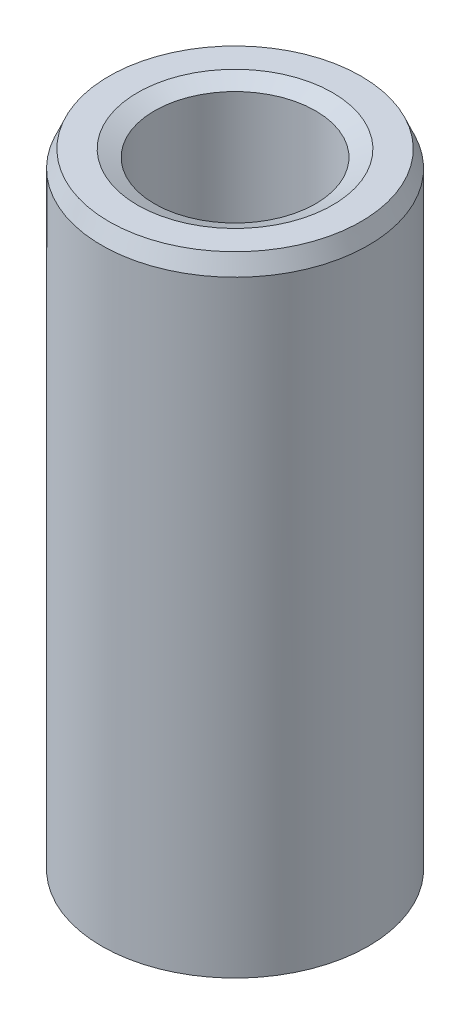
ISO-10303-21;
HEADER;
FILE_DESCRIPTION(('STEP AP214'),'2;1');
FILE_NAME('part.step','',(''),(''),'','','');
FILE_SCHEMA(('AUTOMOTIVE_DESIGN { 1 0 10303 214 1 1 1 1 }'));
ENDSEC;
DATA;
#1=APPLICATION_CONTEXT('core data for automotive mechanical design processes');
#2=APPLICATION_PROTOCOL_DEFINITION('international standard','automotive_design',2000,#1);
#3=PRODUCT_CONTEXT('',#1,'mechanical');
#4=PRODUCT('Part','Part','',(#3));
#5=PRODUCT_RELATED_PRODUCT_CATEGORY('part','',(#4));
#6=PRODUCT_DEFINITION_FORMATION('','',#4);
#7=PRODUCT_DEFINITION_CONTEXT('part definition',#1,'design');
#8=PRODUCT_DEFINITION('design','',#6,#7);
#9=PRODUCT_DEFINITION_SHAPE('','',#8);
#10=(LENGTH_UNIT() NAMED_UNIT(*) SI_UNIT(.MILLI.,.METRE.));
#11=(NAMED_UNIT(*) PLANE_ANGLE_UNIT() SI_UNIT($,.RADIAN.));
#12=(NAMED_UNIT(*) SI_UNIT($,.STERADIAN.) SOLID_ANGLE_UNIT());
#13=UNCERTAINTY_MEASURE_WITH_UNIT(LENGTH_MEASURE(1.E-05),#10,'distance_accuracy_value','');
#14=(GEOMETRIC_REPRESENTATION_CONTEXT(3) GLOBAL_UNCERTAINTY_ASSIGNED_CONTEXT((#13)) GLOBAL_UNIT_ASSIGNED_CONTEXT((#10,
#11,#12)) REPRESENTATION_CONTEXT('',''));
#15=CARTESIAN_POINT('',(0.,0.,0.));
#16=DIRECTION('',(0.,0.,1.));
#17=DIRECTION('',(1.,0.,0.));
#18=AXIS2_PLACEMENT_3D('',#15,#16,#17);
#19=CARTESIAN_POINT('',(0.,106.518927393168,0.));
#20=DIRECTION('',(0.,-1.,0.));
#21=DIRECTION('',(0.,0.,-1.));
#22=AXIS2_PLACEMENT_3D('',#19,#20,#21);
#23=CYLINDRICAL_SURFACE('',#22,22.5);
#24=CARTESIAN_POINT('',(0.,1.23412668733276,0.));
#25=DIRECTION('',(0.,1.,0.));
#26=DIRECTION('',(0.,0.,1.));
#27=AXIS2_PLACEMENT_3D('',#24,#25,#26);
#28=CIRCLE('',#27,22.5);
#29=CARTESIAN_POINT('',(0.,1.23412668733276,22.5));
#30=VERTEX_POINT('',#29);
#31=EDGE_CURVE('E10',#30,#30,#28,.T.);
#32=ORIENTED_EDGE('',*,*,#31,.T.);
#33=EDGE_LOOP('',(#32));
#34=FACE_BOUND('',#33,.T.);
#35=CARTESIAN_POINT('',(0.,103.661343386868,0.));
#36=DIRECTION('',(0.,1.,0.));
#37=DIRECTION('',(0.,0.,1.));
#38=AXIS2_PLACEMENT_3D('',#35,#36,#37);
#39=CIRCLE('',#38,22.5);
#40=CARTESIAN_POINT('',(0.,103.661343386868,-22.5));
#41=VERTEX_POINT('',#40);
#42=EDGE_CURVE('E50',#41,#41,#39,.F.);
#43=ORIENTED_EDGE('',*,*,#42,.T.);
#44=EDGE_LOOP('',(#43));
#45=FACE_BOUND('',#44,.T.);
#46=ADVANCED_FACE('F39',(#34,#45),#23,.T.);
#47=CARTESIAN_POINT('',(0.,106.518927393168,0.));
#48=DIRECTION('',(0.,1.,0.));
#49=DIRECTION('',(0.,0.,1.));
#50=AXIS2_PLACEMENT_3D('',#47,#48,#49);
#51=PLANE('',#50);
#52=CARTESIAN_POINT('',(0.,106.518927393168,0.));
#53=DIRECTION('',(0.,1.,0.));
#54=DIRECTION('',(0.,0.,1.));
#55=AXIS2_PLACEMENT_3D('',#52,#53,#54);
#56=CIRCLE('',#55,16.4554926298678);
#57=CARTESIAN_POINT('',(0.,106.518927393168,16.4554926298678));
#58=VERTEX_POINT('',#57);
#59=EDGE_CURVE('E58',#58,#58,#56,.F.);
#60=ORIENTED_EDGE('',*,*,#59,.T.);
#61=EDGE_LOOP('',(#60));
#62=FACE_BOUND('',#61,.T.);
#63=CARTESIAN_POINT('',(0.,106.518927393168,0.));
#64=DIRECTION('',(0.,1.,0.));
#65=DIRECTION('',(0.,0.,1.));
#66=AXIS2_PLACEMENT_3D('',#63,#64,#65);
#67=CIRCLE('',#66,21.2658733126672);
#68=CARTESIAN_POINT('',(0.,106.518927393168,-21.2658733126673));
#69=VERTEX_POINT('',#68);
#70=EDGE_CURVE('E61',#69,#69,#67,.T.);
#71=ORIENTED_EDGE('',*,*,#70,.T.);
#72=EDGE_LOOP('',(#71));
#73=FACE_BOUND('',#72,.T.);
#74=ADVANCED_FACE('F88',(#62,#73),#51,.T.);
#75=CARTESIAN_POINT('',(0.,0.,0.));
#76=DIRECTION('',(0.,1.,0.));
#77=DIRECTION('',(0.,0.,1.));
#78=AXIS2_PLACEMENT_3D('',#75,#76,#77);
#79=PLANE('',#78);
#80=CARTESIAN_POINT('',(0.,0.,0.));
#81=DIRECTION('',(0.,1.,0.));
#82=DIRECTION('',(0.,0.,1.));
#83=AXIS2_PLACEMENT_3D('',#80,#81,#82);
#84=CIRCLE('',#83,14.8320353109006);
#85=CARTESIAN_POINT('',(0.,0.,-14.8320353109006));
#86=VERTEX_POINT('',#85);
#87=EDGE_CURVE('E51',#86,#86,#84,.T.);
#88=ORIENTED_EDGE('',*,*,#87,.T.);
#89=EDGE_LOOP('',(#88));
#90=FACE_BOUND('',#89,.T.);
#91=CARTESIAN_POINT('',(0.,0.,0.));
#92=DIRECTION('',(0.,1.,0.));
#93=DIRECTION('',(0.,0.,1.));
#94=AXIS2_PLACEMENT_3D('',#91,#92,#93);
#95=CIRCLE('',#94,19.6424159937);
#96=CARTESIAN_POINT('',(0.,0.,19.6424159937));
#97=VERTEX_POINT('',#96);
#98=EDGE_CURVE('E54',#97,#97,#95,.F.);
#99=ORIENTED_EDGE('',*,*,#98,.T.);
#100=EDGE_LOOP('',(#99));
#101=FACE_BOUND('',#100,.T.);
#102=ADVANCED_FACE('F83',(#90,#101),#79,.F.);
#103=CARTESIAN_POINT('',(0.,106.518927393168,0.));
#104=DIRECTION('',(0.,-1.,0.));
#105=DIRECTION('',(0.,0.,-1.));
#106=AXIS2_PLACEMENT_3D('',#103,#104,#105);
#107=CYLINDRICAL_SURFACE('',#106,13.5979086235678);
#108=CARTESIAN_POINT('',(0.,105.284800705835,0.));
#109=DIRECTION('',(0.,1.,0.));
#110=DIRECTION('',(0.,0.,1.));
#111=AXIS2_PLACEMENT_3D('',#108,#109,#110);
#112=CIRCLE('',#111,13.5979086235678);
#113=CARTESIAN_POINT('',(0.,105.284800705835,13.5979086235678));
#114=VERTEX_POINT('',#113);
#115=EDGE_CURVE('E67',#114,#114,#112,.T.);
#116=ORIENTED_EDGE('',*,*,#115,.T.);
#117=EDGE_LOOP('',(#116));
#118=FACE_BOUND('',#117,.T.);
#119=CARTESIAN_POINT('',(0.,2.8575840063,0.));
#120=DIRECTION('',(0.,1.,0.));
#121=DIRECTION('',(0.,0.,1.));
#122=AXIS2_PLACEMENT_3D('',#119,#120,#121);
#123=CIRCLE('',#122,13.5979086235678);
#124=CARTESIAN_POINT('',(0.,2.8575840063,-13.5979086235678));
#125=VERTEX_POINT('',#124);
#126=EDGE_CURVE('E69',#125,#125,#123,.F.);
#127=ORIENTED_EDGE('',*,*,#126,.T.);
#128=EDGE_LOOP('',(#127));
#129=FACE_BOUND('',#128,.T.);
#130=ADVANCED_FACE('F71',(#118,#129),#107,.F.);
#131=CARTESIAN_POINT('',(0.,105.284800705835,0.));
#132=DIRECTION('',(0.,1.,0.));
#133=DIRECTION('',(0.,0.,1.));
#134=AXIS2_PLACEMENT_3D('',#131,#132,#133);
#135=CONICAL_SURFACE('',#134,13.5979086235678,1.16311469385704);
#136=ORIENTED_EDGE('',*,*,#59,.F.);
#137=EDGE_LOOP('',(#136));
#138=FACE_BOUND('',#137,.T.);
#139=ORIENTED_EDGE('',*,*,#115,.F.);
#140=EDGE_LOOP('',(#139));
#141=FACE_BOUND('',#140,.T.);
#142=ADVANCED_FACE('F77',(#138,#141),#135,.F.);
#143=CARTESIAN_POINT('',(0.,0.,0.));
#144=DIRECTION('',(0.,-1.,0.));
#145=DIRECTION('',(0.,0.,-1.));
#146=AXIS2_PLACEMENT_3D('',#143,#144,#145);
#147=CONICAL_SURFACE('',#146,14.8320353109006,0.407681632937855);
#148=CARTESIAN_POINT('',(0.,2.8575840063,-13.5979086235678));
#149=CARTESIAN_POINT('',(0.,2.82781750623437,-13.6107641098942));
#150=CARTESIAN_POINT('',(0.,2.79805100616875,-13.6236195962206));
#151=CARTESIAN_POINT('',(0.,2.7385180060375,-13.6493305688733));
#152=CARTESIAN_POINT('',(0.,2.70875150597187,-13.6621860551997));
#153=CARTESIAN_POINT('',(0.,2.64921850584062,-13.6878970278525));
#154=CARTESIAN_POINT('',(0.,2.619452005775,-13.7007525141789));
#155=CARTESIAN_POINT('',(0.,2.55991900564375,-13.7264634868316));
#156=CARTESIAN_POINT('',(0.,2.53015250557812,-13.739318973158));
#157=CARTESIAN_POINT('',(0.,2.47061950544687,-13.7650299458108));
#158=CARTESIAN_POINT('',(0.,2.44085300538125,-13.7778854321372));
#159=CARTESIAN_POINT('',(0.,2.38132000525,-13.8035964047899));
#160=CARTESIAN_POINT('',(0.,2.35155350518437,-13.8164518911163));
#161=CARTESIAN_POINT('',(0.,2.29202050505312,-13.8421628637691));
#162=CARTESIAN_POINT('',(0.,2.2622540049875,-13.8550183500955));
#163=CARTESIAN_POINT('',(0.,2.20272100485625,-13.8807293227482));
#164=CARTESIAN_POINT('',(0.,2.17295450479062,-13.8935848090746));
#165=CARTESIAN_POINT('',(0.,2.11342150465937,-13.9192957817274));
#166=CARTESIAN_POINT('',(0.,2.08365500459375,-13.9321512680538));
#167=CARTESIAN_POINT('',(0.,2.0241220044625,-13.9578622407065));
#168=CARTESIAN_POINT('',(0.,1.99435550439687,-13.9707177270329));
#169=CARTESIAN_POINT('',(0.,1.93482250426562,-13.9964286996857));
#170=CARTESIAN_POINT('',(0.,1.9050560042,-14.0092841860121));
#171=CARTESIAN_POINT('',(0.,1.84552300406875,-14.0349951586648));
#172=CARTESIAN_POINT('',(0.,1.81575650400312,-14.0478506449912));
#173=CARTESIAN_POINT('',(0.,1.75622350387187,-14.073561617644));
#174=CARTESIAN_POINT('',(0.,1.72645700380625,-14.0864171039703));
#175=CARTESIAN_POINT('',(0.,1.666924003675,-14.1121280766231));
#176=CARTESIAN_POINT('',(0.,1.63715750360937,-14.1249835629495));
#177=CARTESIAN_POINT('',(0.,1.57762450347812,-14.1506945356023));
#178=CARTESIAN_POINT('',(0.,1.5478580034125,-14.1635500219286));
#179=CARTESIAN_POINT('',(0.,1.48832500328125,-14.1892609945814));
#180=CARTESIAN_POINT('',(0.,1.45855850321562,-14.2021164809078));
#181=CARTESIAN_POINT('',(0.,1.39902550308437,-14.2278274535606));
#182=CARTESIAN_POINT('',(0.,1.36925900301875,-14.2406829398869));
#183=CARTESIAN_POINT('',(0.,1.3097260028875,-14.2663939125397));
#184=CARTESIAN_POINT('',(0.,1.27995950282187,-14.2792493988661));
#185=CARTESIAN_POINT('',(0.,1.22042650269062,-14.3049603715189));
#186=CARTESIAN_POINT('',(0.,1.190660002625,-14.3178158578452));
#187=CARTESIAN_POINT('',(0.,1.13112700249375,-14.343526830498));
#188=CARTESIAN_POINT('',(0.,1.10136050242812,-14.3563823168244));
#189=CARTESIAN_POINT('',(0.,1.04182750229687,-14.3820932894772));
#190=CARTESIAN_POINT('',(0.,1.01206100223125,-14.3949487758035));
#191=CARTESIAN_POINT('',(0.,0.952528002099999,-14.4206597484563));
#192=CARTESIAN_POINT('',(0.,0.922761502034374,-14.4335152347827));
#193=CARTESIAN_POINT('',(0.,0.863228501903124,-14.4592262074355));
#194=CARTESIAN_POINT('',(0.,0.833462001837499,-14.4720816937618));
#195=CARTESIAN_POINT('',(0.,0.773929001706249,-14.4977926664146));
#196=CARTESIAN_POINT('',(0.,0.744162501640625,-14.510648152741));
#197=CARTESIAN_POINT('',(0.,0.684629501509375,-14.5363591253938));
#198=CARTESIAN_POINT('',(0.,0.65486300144375,-14.5492146117201));
#199=CARTESIAN_POINT('',(0.,0.595330001312499,-14.5749255843729));
#200=CARTESIAN_POINT('',(0.,0.565563501246875,-14.5877810706993));
#201=CARTESIAN_POINT('',(0.,0.506030501115625,-14.6134920433521));
#202=CARTESIAN_POINT('',(0.,0.47626400105,-14.6263475296784));
#203=CARTESIAN_POINT('',(0.,0.41673100091875,-14.6520585023312));
#204=CARTESIAN_POINT('',(0.,0.386964500853125,-14.6649139886576));
#205=CARTESIAN_POINT('',(0.,0.327431500721875,-14.6906249613104));
#206=CARTESIAN_POINT('',(0.,0.29766500065625,-14.7034804476367));
#207=CARTESIAN_POINT('',(0.,0.238132000525,-14.7291914202895));
#208=CARTESIAN_POINT('',(0.,0.208365500459375,-14.7420469066159));
#209=CARTESIAN_POINT('',(0.,0.148832500328125,-14.7677578792686));
#210=CARTESIAN_POINT('',(0.,0.1190660002625,-14.780613365595));
#211=CARTESIAN_POINT('',(0.,0.0595330001312502,-14.8063243382478));
#212=CARTESIAN_POINT('',(0.,0.0297665000656253,-14.8191798245742));
#213=CARTESIAN_POINT('',(0.,0.,-14.8320353109006));
#214=B_SPLINE_CURVE_WITH_KNOTS('',3,(#148,#149,#150,#151,#152,#153,#154,#155,#156,#157,#158,
#159,#160,#161,#162,#163,#164,#165,#166,#167,#168,#169,#170,#171,#172,#173,#174,#175,#176,#177,
#178,#179,#180,#181,#182,#183,#184,#185,#186,#187,#188,#189,#190,#191,#192,#193,#194,#195,#196,
#197,#198,#199,#200,#201,#202,#203,#204,#205,#206,#207,#208,#209,#210,#211,#212,#213),
.UNSPECIFIED.,.F.,.F.,(4,2,2,2,2,2,2,2,2,2,2,2,2,2,2,2,2,2,2,2,2,2,2,2,2,2,2,2,2,2,2,2,4),(0.,
0.097271642803039,0.194543285606079,0.291814928409118,0.389086571212157,0.486358214015196,
0.583629856818235,0.680901499621274,0.778173142424313,0.875444785227353,0.972716428030392,
1.06998807083343,1.16725971363647,1.26453135643951,1.36180299924255,1.45907464204559,
1.55634628484863,1.65361792765167,1.75088957045471,1.84816121325774,1.94543285606078,
2.04270449886382,2.13997614166686,2.2372477844699,2.33451942727294,2.43179107007598,
2.52906271287902,2.62633435568206,2.7236059984851,2.82087764128814,2.91814928409118,
3.01542092689422,3.11269256969725),.UNSPECIFIED.);
#215=EDGE_CURVE('BSEAM73',#125,#86,#214,.T.);
#216=ORIENTED_EDGE('',*,*,#126,.F.);
#217=ORIENTED_EDGE('',*,*,#87,.F.);
#218=ORIENTED_EDGE('',*,*,#215,.T.);
#219=ORIENTED_EDGE('',*,*,#215,.F.);
#220=EDGE_LOOP('',(#216,#218,#217,#219));
#221=FACE_BOUND('',#220,.T.);
#222=ADVANCED_FACE('F73',(#221),#147,.F.);
#223=CARTESIAN_POINT('',(0.,1.23412668733276,0.));
#224=DIRECTION('',(0.,1.,0.));
#225=DIRECTION('',(0.,0.,1.));
#226=AXIS2_PLACEMENT_3D('',#223,#224,#225);
#227=CONICAL_SURFACE('',#226,22.5,1.16311469385704);
#228=ORIENTED_EDGE('',*,*,#98,.F.);
#229=EDGE_LOOP('',(#228));
#230=FACE_BOUND('',#229,.T.);
#231=ORIENTED_EDGE('',*,*,#31,.F.);
#232=EDGE_LOOP('',(#231));
#233=FACE_BOUND('',#232,.T.);
#234=ADVANCED_FACE('F76',(#230,#233),#227,.T.);
#235=CARTESIAN_POINT('',(0.,106.518927393168,0.));
#236=DIRECTION('',(0.,-1.,0.));
#237=DIRECTION('',(0.,0.,-1.));
#238=AXIS2_PLACEMENT_3D('',#235,#236,#237);
#239=CONICAL_SURFACE('',#238,21.2658733126672,0.407681632937853);
#240=CARTESIAN_POINT('',(0.,103.661343386868,-22.5));
#241=CARTESIAN_POINT('',(0.,103.691109886933,-22.4871445136736));
#242=CARTESIAN_POINT('',(0.,103.720876386999,-22.4742890273472));
#243=CARTESIAN_POINT('',(0.,103.78040938713,-22.4485780546945));
#244=CARTESIAN_POINT('',(0.,103.810175887196,-22.4357225683681));
#245=CARTESIAN_POINT('',(0.,103.869708887327,-22.4100115957153));
#246=CARTESIAN_POINT('',(0.,103.899475387393,-22.3971561093889));
#247=CARTESIAN_POINT('',(0.,103.959008387524,-22.3714451367362));
#248=CARTESIAN_POINT('',(0.,103.98877488759,-22.3585896504098));
#249=CARTESIAN_POINT('',(0.,104.048307887721,-22.332878677757));
#250=CARTESIAN_POINT('',(0.,104.078074387787,-22.3200231914306));
#251=CARTESIAN_POINT('',(0.,104.137607387918,-22.2943122187779));
#252=CARTESIAN_POINT('',(0.,104.167373887983,-22.2814567324515));
#253=CARTESIAN_POINT('',(0.,104.226906888115,-22.2557457597987));
#254=CARTESIAN_POINT('',(0.,104.25667338818,-22.2428902734724));
#255=CARTESIAN_POINT('',(0.,104.316206388312,-22.2171793008196));
#256=CARTESIAN_POINT('',(0.,104.345972888377,-22.2043238144932));
#257=CARTESIAN_POINT('',(0.,104.405505888508,-22.1786128418404));
#258=CARTESIAN_POINT('',(0.,104.435272388574,-22.1657573555141));
#259=CARTESIAN_POINT('',(0.,104.494805388705,-22.1400463828613));
#260=CARTESIAN_POINT('',(0.,104.524571888771,-22.1271908965349));
#261=CARTESIAN_POINT('',(0.,104.584104888902,-22.1014799238821));
#262=CARTESIAN_POINT('',(0.,104.613871388968,-22.0886244375558));
#263=CARTESIAN_POINT('',(0.,104.673404389099,-22.062913464903));
#264=CARTESIAN_POINT('',(0.,104.703170889165,-22.0500579785766));
#265=CARTESIAN_POINT('',(0.,104.762703889296,-22.0243470059238));
#266=CARTESIAN_POINT('',(0.,104.792470389362,-22.0114915195975));
#267=CARTESIAN_POINT('',(0.,104.852003389493,-21.9857805469447));
#268=CARTESIAN_POINT('',(0.,104.881769889558,-21.9729250606183));
#269=CARTESIAN_POINT('',(0.,104.94130288969,-21.9472140879655));
#270=CARTESIAN_POINT('',(0.,104.971069389755,-21.9343586016392));
#271=CARTESIAN_POINT('',(0.,105.030602389887,-21.9086476289864));
#272=CARTESIAN_POINT('',(0.,105.060368889952,-21.89579214266));
#273=CARTESIAN_POINT('',(0.,105.119901890083,-21.8700811700072));
#274=CARTESIAN_POINT('',(0.,105.149668390149,-21.8572256836809));
#275=CARTESIAN_POINT('',(0.,105.20920139028,-21.8315147110281));
#276=CARTESIAN_POINT('',(0.,105.238967890346,-21.8186592247017));
#277=CARTESIAN_POINT('',(0.,105.298500890477,-21.7929482520489));
#278=CARTESIAN_POINT('',(0.,105.328267390543,-21.7800927657226));
#279=CARTESIAN_POINT('',(0.,105.387800390674,-21.7543817930698));
#280=CARTESIAN_POINT('',(0.,105.41756689074,-21.7415263067434));
#281=CARTESIAN_POINT('',(0.,105.477099890871,-21.7158153340906));
#282=CARTESIAN_POINT('',(0.,105.506866390937,-21.7029598477643));
#283=CARTESIAN_POINT('',(0.,105.566399391068,-21.6772488751115));
#284=CARTESIAN_POINT('',(0.,105.596165891133,-21.6643933887851));
#285=CARTESIAN_POINT('',(0.,105.655698891265,-21.6386824161324));
#286=CARTESIAN_POINT('',(0.,105.68546539133,-21.625826929806));
#287=CARTESIAN_POINT('',(0.,105.744998391462,-21.6001159571532));
#288=CARTESIAN_POINT('',(0.,105.774764891527,-21.5872604708268));
#289=CARTESIAN_POINT('',(0.,105.834297891658,-21.5615494981741));
#290=CARTESIAN_POINT('',(0.,105.864064391724,-21.5486940118477));
#291=CARTESIAN_POINT('',(0.,105.923597391855,-21.5229830391949));
#292=CARTESIAN_POINT('',(0.,105.953363891921,-21.5101275528685));
#293=CARTESIAN_POINT('',(0.,106.012896892052,-21.4844165802158));
#294=CARTESIAN_POINT('',(0.,106.042663392118,-21.4715610938894));
#295=CARTESIAN_POINT('',(0.,106.102196392249,-21.4458501212366));
#296=CARTESIAN_POINT('',(0.,106.131962892315,-21.4329946349102));
#297=CARTESIAN_POINT('',(0.,106.191495892446,-21.4072836622575));
#298=CARTESIAN_POINT('',(0.,106.221262392512,-21.3944281759311));
#299=CARTESIAN_POINT('',(0.,106.280795392643,-21.3687172032783));
#300=CARTESIAN_POINT('',(0.,106.310561892708,-21.3558617169519));
#301=CARTESIAN_POINT('',(0.,106.37009489284,-21.3301507442992));
#302=CARTESIAN_POINT('',(0.,106.399861392905,-21.3172952579728));
#303=CARTESIAN_POINT('',(0.,106.459394393037,-21.29158428532));
#304=CARTESIAN_POINT('',(0.,106.489160893102,-21.2787287989936));
#305=CARTESIAN_POINT('',(0.,106.518927393168,-21.2658733126673));
#306=B_SPLINE_CURVE_WITH_KNOTS('',3,(#240,#241,#242,#243,#244,#245,#246,#247,#248,#249,#250,
#251,#252,#253,#254,#255,#256,#257,#258,#259,#260,#261,#262,#263,#264,#265,#266,#267,#268,#269,
#270,#271,#272,#273,#274,#275,#276,#277,#278,#279,#280,#281,#282,#283,#284,#285,#286,#287,#288,
#289,#290,#291,#292,#293,#294,#295,#296,#297,#298,#299,#300,#301,#302,#303,#304,#305),
.UNSPECIFIED.,.F.,.F.,(4,2,2,2,2,2,2,2,2,2,2,2,2,2,2,2,2,2,2,2,2,2,2,2,2,2,2,2,2,2,2,2,4),(0.,
0.0972716428030488,0.194543285606084,0.29181492840912,0.389086571212154,0.486358214015203,
0.583629856818238,0.680901499621274,0.778173142424309,0.875444785227358,0.972716428030392,
1.06998807083343,1.16725971363646,1.26453135643951,1.36180299924255,1.45907464204558,
1.55634628484862,1.65361792765167,1.7508895704547,1.84816121325774,1.94543285606077,
2.04270449886382,2.13997614166686,2.23724778446989,2.33451942727294,2.43179107007598,
2.52906271287901,2.62633435568205,2.7236059984851,2.82087764128813,2.91814928409117,
3.0154209268942,3.11269256969725),.UNSPECIFIED.);
#307=EDGE_CURVE('BSEAM45',#41,#69,#306,.T.);
#308=ORIENTED_EDGE('',*,*,#42,.F.);
#309=ORIENTED_EDGE('',*,*,#70,.F.);
#310=ORIENTED_EDGE('',*,*,#307,.T.);
#311=ORIENTED_EDGE('',*,*,#307,.F.);
#312=EDGE_LOOP('',(#308,#310,#309,#311));
#313=FACE_BOUND('',#312,.T.);
#314=ADVANCED_FACE('F45',(#313),#239,.T.);
#315=CLOSED_SHELL('',(#46,#74,#102,#130,#142,#222,#234,#314));
#316=MANIFOLD_SOLID_BREP('B2',#315);
#317=ADVANCED_BREP_SHAPE_REPRESENTATION('',(#18,#316),#14);
#318=SHAPE_DEFINITION_REPRESENTATION(#9,#317);
ENDSEC;
END-ISO-10303-21;
